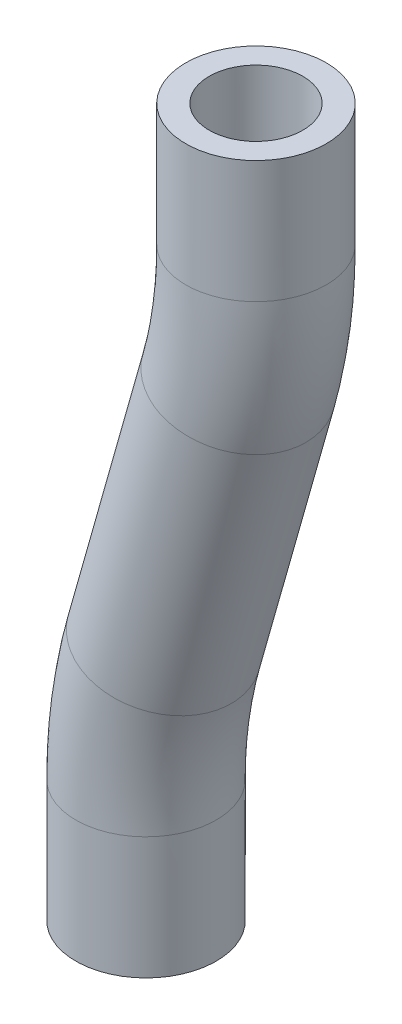
ISO-10303-21;
HEADER;
FILE_DESCRIPTION(('STEP AP214'),'2;1');
FILE_NAME('part.step','',(''),(''),'','','');
FILE_SCHEMA(('AUTOMOTIVE_DESIGN { 1 0 10303 214 1 1 1 1 }'));
ENDSEC;
DATA;
#1=APPLICATION_CONTEXT('core data for automotive mechanical design processes');
#2=APPLICATION_PROTOCOL_DEFINITION('international standard','automotive_design',2000,#1);
#3=PRODUCT_CONTEXT('',#1,'mechanical');
#4=PRODUCT('Part','Part','',(#3));
#5=PRODUCT_RELATED_PRODUCT_CATEGORY('part','',(#4));
#6=PRODUCT_DEFINITION_FORMATION('','',#4);
#7=PRODUCT_DEFINITION_CONTEXT('part definition',#1,'design');
#8=PRODUCT_DEFINITION('design','',#6,#7);
#9=PRODUCT_DEFINITION_SHAPE('','',#8);
#10=(LENGTH_UNIT() NAMED_UNIT(*) SI_UNIT(.MILLI.,.METRE.));
#11=(NAMED_UNIT(*) PLANE_ANGLE_UNIT() SI_UNIT($,.RADIAN.));
#12=(NAMED_UNIT(*) SI_UNIT($,.STERADIAN.) SOLID_ANGLE_UNIT());
#13=UNCERTAINTY_MEASURE_WITH_UNIT(LENGTH_MEASURE(1.E-05),#10,'distance_accuracy_value','');
#14=(GEOMETRIC_REPRESENTATION_CONTEXT(3) GLOBAL_UNCERTAINTY_ASSIGNED_CONTEXT((#13)) GLOBAL_UNIT_ASSIGNED_CONTEXT((#10,
#11,#12)) REPRESENTATION_CONTEXT('',''));
#15=CARTESIAN_POINT('',(0.,0.,0.));
#16=DIRECTION('',(0.,0.,1.));
#17=DIRECTION('',(1.,0.,0.));
#18=AXIS2_PLACEMENT_3D('',#15,#16,#17);
#19=CARTESIAN_POINT('',(0.,0.,0.));
#20=DIRECTION('',(0.,-1.,0.));
#21=DIRECTION('',(0.,0.,-1.));
#22=AXIS2_PLACEMENT_3D('',#19,#20,#21);
#23=PLANE('',#22);
#24=CARTESIAN_POINT('',(0.,0.,0.));
#25=DIRECTION('',(0.,-1.,0.));
#26=DIRECTION('',(0.,0.,-1.));
#27=AXIS2_PLACEMENT_3D('',#24,#25,#26);
#28=CIRCLE('',#27,2.);
#29=CARTESIAN_POINT('',(0.,0.,-2.));
#30=VERTEX_POINT('',#29);
#31=EDGE_CURVE('E73',#30,#30,#28,.T.);
#32=ORIENTED_EDGE('',*,*,#31,.F.);
#33=EDGE_LOOP('',(#32));
#34=FACE_BOUND('',#33,.T.);
#35=CARTESIAN_POINT('',(0.,0.,0.));
#36=DIRECTION('',(0.,-1.,0.));
#37=DIRECTION('',(0.,0.,-1.));
#38=AXIS2_PLACEMENT_3D('',#35,#36,#37);
#39=CIRCLE('',#38,3.);
#40=CARTESIAN_POINT('',(0.,0.,-3.));
#41=VERTEX_POINT('',#40);
#42=EDGE_CURVE('E66',#41,#41,#39,.T.);
#43=ORIENTED_EDGE('',*,*,#42,.T.);
#44=EDGE_LOOP('',(#43));
#45=FACE_BOUND('',#44,.T.);
#46=ADVANCED_FACE('F44',(#34,#45),#23,.T.);
#47=CARTESIAN_POINT('',(4.7,32.6,0.));
#48=DIRECTION('',(0.,-1.,0.));
#49=DIRECTION('',(0.,0.,-1.));
#50=AXIS2_PLACEMENT_3D('',#47,#48,#49);
#51=PLANE('',#50);
#52=CARTESIAN_POINT('',(4.7,32.6,0.));
#53=DIRECTION('',(0.,-1.,0.));
#54=DIRECTION('',(0.,0.,-1.));
#55=AXIS2_PLACEMENT_3D('',#52,#53,#54);
#56=CIRCLE('',#55,2.);
#57=CARTESIAN_POINT('',(4.7,32.6,-2.));
#58=VERTEX_POINT('',#57);
#59=EDGE_CURVE('E69',#58,#58,#56,.T.);
#60=ORIENTED_EDGE('',*,*,#59,.T.);
#61=EDGE_LOOP('',(#60));
#62=FACE_BOUND('',#61,.T.);
#63=CARTESIAN_POINT('',(4.7,32.6,0.));
#64=DIRECTION('',(0.,-1.,0.));
#65=DIRECTION('',(0.,0.,-1.));
#66=AXIS2_PLACEMENT_3D('',#63,#64,#65);
#67=CIRCLE('',#66,3.);
#68=CARTESIAN_POINT('',(4.7,32.6,-3.));
#69=VERTEX_POINT('',#68);
#70=EDGE_CURVE('E11',#69,#69,#67,.T.);
#71=ORIENTED_EDGE('',*,*,#70,.F.);
#72=EDGE_LOOP('',(#71));
#73=FACE_BOUND('',#72,.T.);
#74=ADVANCED_FACE('F99',(#62,#73),#51,.F.);
#75=CARTESIAN_POINT('',(0.,0.,0.));
#76=DIRECTION('',(0.,1.,0.));
#77=DIRECTION('',(-1.,0.,0.));
#78=AXIS2_PLACEMENT_3D('',#75,#76,#77);
#79=CYLINDRICAL_SURFACE('',#78,3.);
#80=CARTESIAN_POINT('',(0.,5.22325087037015,0.));
#81=DIRECTION('',(0.,-1.,0.));
#82=DIRECTION('',(0.,0.,-1.));
#83=AXIS2_PLACEMENT_3D('',#80,#81,#82);
#84=CIRCLE('',#83,3.);
#85=CARTESIAN_POINT('',(-2.99999999999989,5.22325087037014,0.));
#86=VERTEX_POINT('',#85);
#87=EDGE_CURVE('E63',#86,#86,#84,.T.);
#88=ORIENTED_EDGE('',*,*,#87,.T.);
#89=EDGE_LOOP('',(#88));
#90=FACE_BOUND('',#89,.T.);
#91=ORIENTED_EDGE('',*,*,#42,.F.);
#92=EDGE_LOOP('',(#91));
#93=FACE_BOUND('',#92,.T.);
#94=ADVANCED_FACE('F103',(#90,#93),#79,.T.);
#95=CARTESIAN_POINT('',(20.,5.22325087037023,0.));
#96=DIRECTION('',(0.,0.,-1.));
#97=DIRECTION('',(-1.,0.,0.));
#98=AXIS2_PLACEMENT_3D('',#95,#96,#97);
#99=TOROIDAL_SURFACE('',#98,19.9999999999999,3.);
#100=CARTESIAN_POINT('',(0.756452319523905,10.6717252136376,0.));
#101=DIRECTION('',(-0.27242371716337,-0.962177384023805,0.));
#102=DIRECTION('',(0.,0.,-1.));
#103=AXIS2_PLACEMENT_3D('',#100,#101,#102);
#104=CIRCLE('',#103,3.);
#105=CARTESIAN_POINT('',(-2.1300798325474,11.4889963651277,0.));
#106=VERTEX_POINT('',#105);
#107=EDGE_CURVE('E58',#106,#106,#104,.T.);
#108=CARTESIAN_POINT('',(20.,5.22325087037023,0.));
#109=DIRECTION('',(0.,0.,-1.));
#110=DIRECTION('',(-1.,0.,0.));
#111=AXIS2_PLACEMENT_3D('',#108,#109,#110);
#112=CIRCLE('',#111,22.9999999999999);
#113=EDGE_CURVE('',#86,#106,#112,.T.);
#114=ORIENTED_EDGE('',*,*,#87,.F.);
#115=ORIENTED_EDGE('',*,*,#107,.T.);
#116=ORIENTED_EDGE('',*,*,#113,.T.);
#117=ORIENTED_EDGE('',*,*,#113,.F.);
#118=EDGE_LOOP('',(#114,#116,#115,#117));
#119=FACE_BOUND('',#118,.T.);
#120=ADVANCED_FACE('F105',(#119),#99,.T.);
#121=CARTESIAN_POINT('',(0.756452319523903,10.6717252136376,0.));
#122=DIRECTION('',(0.272423717163367,0.962177384023806,0.));
#123=DIRECTION('',(-0.962177384023806,0.272423717163367,0.));
#124=AXIS2_PLACEMENT_3D('',#121,#122,#123);
#125=CYLINDRICAL_SURFACE('',#124,3.);
#126=CARTESIAN_POINT('',(3.94354768047609,21.9282747863624,0.));
#127=DIRECTION('',(-0.272423717163367,-0.962177384023806,0.));
#128=DIRECTION('',(0.,0.,-1.));
#129=AXIS2_PLACEMENT_3D('',#126,#127,#128);
#130=CIRCLE('',#129,3.);
#131=CARTESIAN_POINT('',(6.8300798325475,21.1110036348723,0.));
#132=VERTEX_POINT('',#131);
#133=EDGE_CURVE('E54',#132,#132,#130,.T.);
#134=ORIENTED_EDGE('',*,*,#133,.T.);
#135=EDGE_LOOP('',(#134));
#136=FACE_BOUND('',#135,.T.);
#137=ORIENTED_EDGE('',*,*,#107,.F.);
#138=EDGE_LOOP('',(#137));
#139=FACE_BOUND('',#138,.T.);
#140=ADVANCED_FACE('F112',(#136,#139),#125,.T.);
#141=CARTESIAN_POINT('',(-15.3,27.3767491296298,0.));
#142=DIRECTION('',(0.,0.,1.));
#143=DIRECTION('',(1.,0.,0.));
#144=AXIS2_PLACEMENT_3D('',#141,#142,#143);
#145=TOROIDAL_SURFACE('',#144,20.,3.);
#146=CARTESIAN_POINT('',(4.69999999999999,27.3767491296298,0.));
#147=DIRECTION('',(0.,-1.,0.));
#148=DIRECTION('',(0.,0.,-1.));
#149=AXIS2_PLACEMENT_3D('',#146,#147,#148);
#150=CIRCLE('',#149,3.);
#151=CARTESIAN_POINT('',(7.69999999999999,27.3767491296298,0.));
#152=VERTEX_POINT('',#151);
#153=EDGE_CURVE('E50',#152,#152,#150,.T.);
#154=CARTESIAN_POINT('',(-15.3,27.3767491296298,0.));
#155=DIRECTION('',(0.,0.,1.));
#156=DIRECTION('',(1.,0.,0.));
#157=AXIS2_PLACEMENT_3D('',#154,#155,#156);
#158=CIRCLE('',#157,23.);
#159=EDGE_CURVE('',#132,#152,#158,.T.);
#160=ORIENTED_EDGE('',*,*,#133,.F.);
#161=ORIENTED_EDGE('',*,*,#153,.T.);
#162=ORIENTED_EDGE('',*,*,#159,.T.);
#163=ORIENTED_EDGE('',*,*,#159,.F.);
#164=EDGE_LOOP('',(#160,#162,#161,#163));
#165=FACE_BOUND('',#164,.T.);
#166=ADVANCED_FACE('F118',(#165),#145,.T.);
#167=CARTESIAN_POINT('',(4.7,27.3767491296298,0.));
#168=DIRECTION('',(0.,1.,0.));
#169=DIRECTION('',(-1.,0.,0.));
#170=AXIS2_PLACEMENT_3D('',#167,#168,#169);
#171=CYLINDRICAL_SURFACE('',#170,3.);
#172=ORIENTED_EDGE('',*,*,#70,.T.);
#173=EDGE_LOOP('',(#172));
#174=FACE_BOUND('',#173,.T.);
#175=ORIENTED_EDGE('',*,*,#153,.F.);
#176=EDGE_LOOP('',(#175));
#177=FACE_BOUND('',#176,.T.);
#178=ADVANCED_FACE('F93',(#174,#177),#171,.T.);
#179=CARTESIAN_POINT('',(0.,0.,0.));
#180=DIRECTION('',(0.,1.,0.));
#181=DIRECTION('',(-1.,0.,0.));
#182=AXIS2_PLACEMENT_3D('',#179,#180,#181);
#183=CYLINDRICAL_SURFACE('',#182,2.);
#184=CARTESIAN_POINT('',(0.,5.22325087037015,0.));
#185=DIRECTION('',(0.,1.,0.));
#186=DIRECTION('',(-1.,0.,0.));
#187=AXIS2_PLACEMENT_3D('',#184,#185,#186);
#188=CIRCLE('',#187,2.);
#189=CARTESIAN_POINT('',(-1.99999999999989,5.22325087037014,0.));
#190=VERTEX_POINT('',#189);
#191=EDGE_CURVE('E76',#190,#190,#188,.F.);
#192=ORIENTED_EDGE('',*,*,#191,.F.);
#193=EDGE_LOOP('',(#192));
#194=FACE_BOUND('',#193,.T.);
#195=ORIENTED_EDGE('',*,*,#31,.T.);
#196=EDGE_LOOP('',(#195));
#197=FACE_BOUND('',#196,.T.);
#198=ADVANCED_FACE('F90',(#194,#197),#183,.F.);
#199=CARTESIAN_POINT('',(20.,5.22325087037023,0.));
#200=DIRECTION('',(0.,0.,-1.));
#201=DIRECTION('',(-1.,0.,0.));
#202=AXIS2_PLACEMENT_3D('',#199,#200,#201);
#203=TOROIDAL_SURFACE('',#202,19.9999999999999,2.);
#204=CARTESIAN_POINT('',(0.756452319524013,10.6717252136376,0.));
#205=DIRECTION('',(-0.27242371716337,-0.962177384023805,0.));
#206=DIRECTION('',(0.962177384023805,-0.27242371716337,0.));
#207=AXIS2_PLACEMENT_3D('',#204,#205,#206);
#208=CIRCLE('',#207,2.);
#209=CARTESIAN_POINT('',(-1.1679024485236,11.2165726479643,0.));
#210=VERTEX_POINT('',#209);
#211=EDGE_CURVE('E82',#210,#210,#208,.T.);
#212=CARTESIAN_POINT('',(20.,5.22325087037023,0.));
#213=DIRECTION('',(0.,0.,-1.));
#214=DIRECTION('',(-1.,0.,0.));
#215=AXIS2_PLACEMENT_3D('',#212,#213,#214);
#216=CIRCLE('',#215,21.9999999999999);
#217=EDGE_CURVE('',#190,#210,#216,.T.);
#218=ORIENTED_EDGE('',*,*,#191,.T.);
#219=ORIENTED_EDGE('',*,*,#211,.F.);
#220=ORIENTED_EDGE('',*,*,#217,.T.);
#221=ORIENTED_EDGE('',*,*,#217,.F.);
#222=EDGE_LOOP('',(#218,#220,#219,#221));
#223=FACE_BOUND('',#222,.T.);
#224=ADVANCED_FACE('F88',(#223),#203,.F.);
#225=CARTESIAN_POINT('',(0.756452319523903,10.6717252136376,0.));
#226=DIRECTION('',(0.272423717163367,0.962177384023806,0.));
#227=DIRECTION('',(-0.962177384023806,0.272423717163367,0.));
#228=AXIS2_PLACEMENT_3D('',#225,#226,#227);
#229=CYLINDRICAL_SURFACE('',#228,2.);
#230=CARTESIAN_POINT('',(3.94354768047609,21.9282747863624,0.));
#231=DIRECTION('',(0.272423717163367,0.962177384023806,0.));
#232=DIRECTION('',(-0.962177384023806,0.272423717163367,0.));
#233=AXIS2_PLACEMENT_3D('',#230,#231,#232);
#234=CIRCLE('',#233,2.);
#235=CARTESIAN_POINT('',(5.8679024485237,21.3834273520356,0.));
#236=VERTEX_POINT('',#235);
#237=EDGE_CURVE('E79',#236,#236,#234,.F.);
#238=ORIENTED_EDGE('',*,*,#237,.F.);
#239=EDGE_LOOP('',(#238));
#240=FACE_BOUND('',#239,.T.);
#241=ORIENTED_EDGE('',*,*,#211,.T.);
#242=EDGE_LOOP('',(#241));
#243=FACE_BOUND('',#242,.T.);
#244=ADVANCED_FACE('F161',(#240,#243),#229,.F.);
#245=CARTESIAN_POINT('',(-15.3,27.3767491296298,0.));
#246=DIRECTION('',(0.,0.,1.));
#247=DIRECTION('',(1.,0.,0.));
#248=AXIS2_PLACEMENT_3D('',#245,#246,#247);
#249=TOROIDAL_SURFACE('',#248,20.,2.);
#250=CARTESIAN_POINT('',(4.7,27.3767491296298,0.));
#251=DIRECTION('',(0.,-1.,0.));
#252=DIRECTION('',(0.,0.,-1.));
#253=AXIS2_PLACEMENT_3D('',#250,#251,#252);
#254=CIRCLE('',#253,2.);
#255=CARTESIAN_POINT('',(6.7,27.3767491296298,0.));
#256=VERTEX_POINT('',#255);
#257=EDGE_CURVE('E72',#256,#256,#254,.T.);
#258=CARTESIAN_POINT('',(-15.3,27.3767491296298,0.));
#259=DIRECTION('',(0.,0.,1.));
#260=DIRECTION('',(1.,0.,0.));
#261=AXIS2_PLACEMENT_3D('',#258,#259,#260);
#262=CIRCLE('',#261,22.);
#263=EDGE_CURVE('',#236,#256,#262,.T.);
#264=ORIENTED_EDGE('',*,*,#237,.T.);
#265=ORIENTED_EDGE('',*,*,#257,.F.);
#266=ORIENTED_EDGE('',*,*,#263,.T.);
#267=ORIENTED_EDGE('',*,*,#263,.F.);
#268=EDGE_LOOP('',(#264,#266,#265,#267));
#269=FACE_BOUND('',#268,.T.);
#270=ADVANCED_FACE('F171',(#269),#249,.F.);
#271=CARTESIAN_POINT('',(4.7,27.3767491296298,0.));
#272=DIRECTION('',(0.,1.,0.));
#273=DIRECTION('',(-1.,0.,0.));
#274=AXIS2_PLACEMENT_3D('',#271,#272,#273);
#275=CYLINDRICAL_SURFACE('',#274,2.);
#276=ORIENTED_EDGE('',*,*,#59,.F.);
#277=EDGE_LOOP('',(#276));
#278=FACE_BOUND('',#277,.T.);
#279=ORIENTED_EDGE('',*,*,#257,.T.);
#280=EDGE_LOOP('',(#279));
#281=FACE_BOUND('',#280,.T.);
#282=ADVANCED_FACE('F100',(#278,#281),#275,.F.);
#283=CLOSED_SHELL('',(#46,#74,#94,#120,#140,#166,#178,#198,#224,#244,#270,#282));
#284=MANIFOLD_SOLID_BREP('B2',#283);
#285=ADVANCED_BREP_SHAPE_REPRESENTATION('',(#18,#284),#14);
#286=SHAPE_DEFINITION_REPRESENTATION(#9,#285);
ENDSEC;
END-ISO-10303-21;
